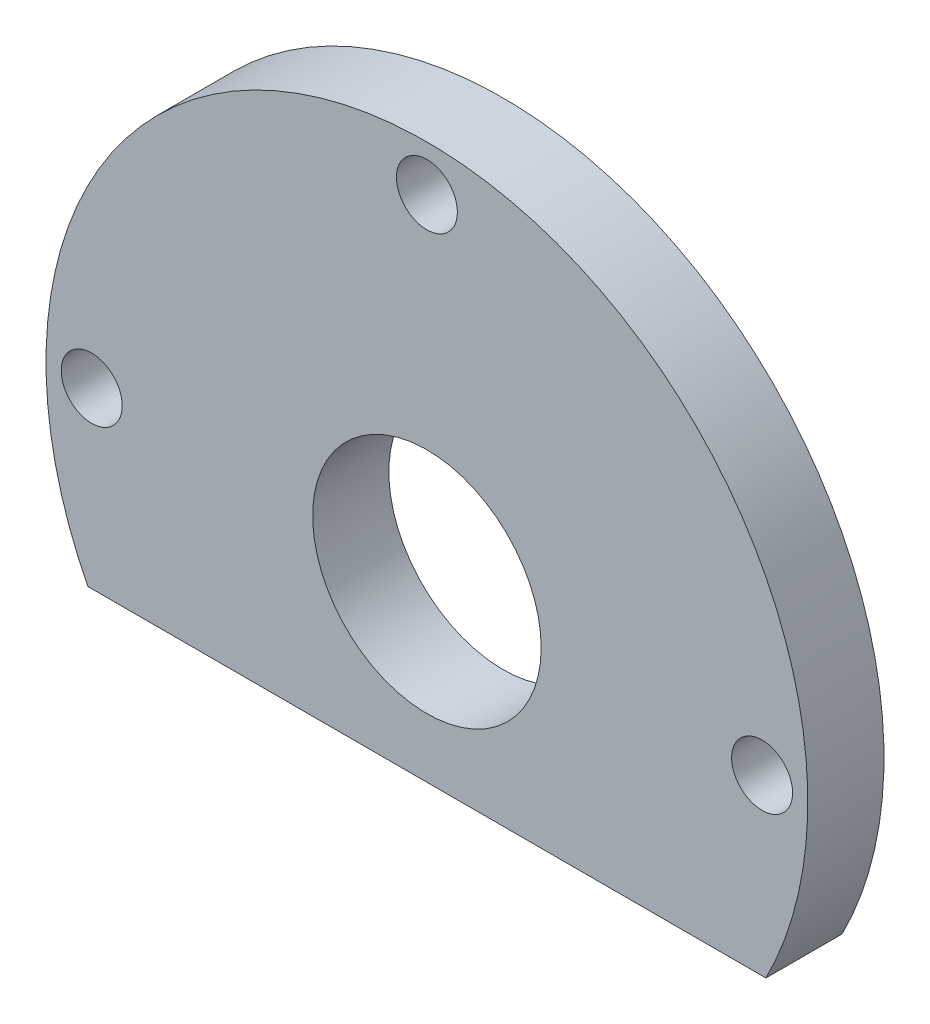
ISO-10303-21;
HEADER;
FILE_DESCRIPTION(('STEP AP214'),'2;1');
FILE_NAME('part.step','',(''),(''),'','','');
FILE_SCHEMA(('AUTOMOTIVE_DESIGN { 1 0 10303 214 1 1 1 1 }'));
ENDSEC;
DATA;
#1=APPLICATION_CONTEXT('core data for automotive mechanical design processes');
#2=APPLICATION_PROTOCOL_DEFINITION('international standard','automotive_design',2000,#1);
#3=PRODUCT_CONTEXT('',#1,'mechanical');
#4=PRODUCT('Part','Part','',(#3));
#5=PRODUCT_RELATED_PRODUCT_CATEGORY('part','',(#4));
#6=PRODUCT_DEFINITION_FORMATION('','',#4);
#7=PRODUCT_DEFINITION_CONTEXT('part definition',#1,'design');
#8=PRODUCT_DEFINITION('design','',#6,#7);
#9=PRODUCT_DEFINITION_SHAPE('','',#8);
#10=(LENGTH_UNIT() NAMED_UNIT(*) SI_UNIT(.MILLI.,.METRE.));
#11=(NAMED_UNIT(*) PLANE_ANGLE_UNIT() SI_UNIT($,.RADIAN.));
#12=(NAMED_UNIT(*) SI_UNIT($,.STERADIAN.) SOLID_ANGLE_UNIT());
#13=UNCERTAINTY_MEASURE_WITH_UNIT(LENGTH_MEASURE(1.E-05),#10,'distance_accuracy_value','');
#14=(GEOMETRIC_REPRESENTATION_CONTEXT(3) GLOBAL_UNCERTAINTY_ASSIGNED_CONTEXT((#13)) GLOBAL_UNIT_ASSIGNED_CONTEXT((#10,
#11,#12)) REPRESENTATION_CONTEXT('',''));
#15=CARTESIAN_POINT('',(0.,0.,0.));
#16=DIRECTION('',(0.,0.,1.));
#17=DIRECTION('',(1.,0.,0.));
#18=AXIS2_PLACEMENT_3D('',#15,#16,#17);
#19=CARTESIAN_POINT('',(0.,0.,5.));
#20=DIRECTION('',(0.,0.,1.));
#21=DIRECTION('',(1.,0.,0.));
#22=AXIS2_PLACEMENT_3D('',#19,#20,#21);
#23=PLANE('',#22);
#24=DIRECTION('',(-1.,0.,0.));
#25=VECTOR('',#24,1.);
#26=CARTESIAN_POINT('',(-22.2496891500867,-11.39961985,5.));
#27=LINE('',#26,#25);
#28=CARTESIAN_POINT('',(22.2496891500867,-11.39961985,5.));
#29=VERTEX_POINT('',#28);
#30=CARTESIAN_POINT('',(-22.2496891500867,-11.39961985,5.));
#31=VERTEX_POINT('',#30);
#32=EDGE_CURVE('E48',#29,#31,#27,.T.);
#33=ORIENTED_EDGE('',*,*,#32,.F.);
#34=CARTESIAN_POINT('',(0.,0.,5.));
#35=DIRECTION('',(0.,0.,1.));
#36=DIRECTION('',(1.,0.,0.));
#37=AXIS2_PLACEMENT_3D('',#34,#35,#36);
#38=CIRCLE('',#37,25.);
#39=EDGE_CURVE('E11',#29,#31,#38,.T.);
#40=ORIENTED_EDGE('',*,*,#39,.T.);
#41=EDGE_LOOP('',(#33,#40));
#42=FACE_BOUND('',#41,.T.);
#43=CARTESIAN_POINT('',(0.,22.,5.));
#44=DIRECTION('',(0.,0.,1.));
#45=DIRECTION('',(1.,0.,0.));
#46=AXIS2_PLACEMENT_3D('',#43,#44,#45);
#47=CIRCLE('',#46,2.);
#48=CARTESIAN_POINT('',(2.,22.,5.));
#49=VERTEX_POINT('',#48);
#50=EDGE_CURVE('E79',#49,#49,#47,.T.);
#51=ORIENTED_EDGE('',*,*,#50,.F.);
#52=EDGE_LOOP('',(#51));
#53=FACE_BOUND('',#52,.T.);
#54=CARTESIAN_POINT('',(22.,0.,5.));
#55=DIRECTION('',(0.,0.,1.));
#56=DIRECTION('',(1.,0.,0.));
#57=AXIS2_PLACEMENT_3D('',#54,#55,#56);
#58=CIRCLE('',#57,2.);
#59=CARTESIAN_POINT('',(24.,0.,5.));
#60=VERTEX_POINT('',#59);
#61=EDGE_CURVE('E85',#60,#60,#58,.T.);
#62=ORIENTED_EDGE('',*,*,#61,.F.);
#63=EDGE_LOOP('',(#62));
#64=FACE_BOUND('',#63,.T.);
#65=CARTESIAN_POINT('',(-22.,0.,5.));
#66=DIRECTION('',(0.,0.,1.));
#67=DIRECTION('',(1.,0.,0.));
#68=AXIS2_PLACEMENT_3D('',#65,#66,#67);
#69=CIRCLE('',#68,2.);
#70=CARTESIAN_POINT('',(-20.,0.,5.));
#71=VERTEX_POINT('',#70);
#72=EDGE_CURVE('E91',#71,#71,#69,.T.);
#73=ORIENTED_EDGE('',*,*,#72,.F.);
#74=EDGE_LOOP('',(#73));
#75=FACE_BOUND('',#74,.T.);
#76=CARTESIAN_POINT('',(0.,0.,5.));
#77=DIRECTION('',(0.,0.,1.));
#78=DIRECTION('',(1.,0.,0.));
#79=AXIS2_PLACEMENT_3D('',#76,#77,#78);
#80=CIRCLE('',#79,7.5);
#81=CARTESIAN_POINT('',(7.5,0.,5.));
#82=VERTEX_POINT('',#81);
#83=EDGE_CURVE('E73',#82,#82,#80,.T.);
#84=ORIENTED_EDGE('',*,*,#83,.F.);
#85=EDGE_LOOP('',(#84));
#86=FACE_BOUND('',#85,.T.);
#87=ADVANCED_FACE('F33',(#42,#53,#64,#75,#86),#23,.T.);
#88=CARTESIAN_POINT('',(0.,0.,0.));
#89=DIRECTION('',(0.,0.,1.));
#90=DIRECTION('',(1.,0.,0.));
#91=AXIS2_PLACEMENT_3D('',#88,#89,#90);
#92=PLANE('',#91);
#93=CARTESIAN_POINT('',(0.,22.,0.));
#94=DIRECTION('',(0.,0.,1.));
#95=DIRECTION('',(1.,0.,0.));
#96=AXIS2_PLACEMENT_3D('',#93,#94,#95);
#97=CIRCLE('',#96,2.);
#98=CARTESIAN_POINT('',(2.,22.,0.));
#99=VERTEX_POINT('',#98);
#100=EDGE_CURVE('E68',#99,#99,#97,.T.);
#101=ORIENTED_EDGE('',*,*,#100,.T.);
#102=EDGE_LOOP('',(#101));
#103=FACE_BOUND('',#102,.T.);
#104=CARTESIAN_POINT('',(22.,0.,0.));
#105=DIRECTION('',(0.,0.,1.));
#106=DIRECTION('',(1.,0.,0.));
#107=AXIS2_PLACEMENT_3D('',#104,#105,#106);
#108=CIRCLE('',#107,2.);
#109=CARTESIAN_POINT('',(24.,0.,0.));
#110=VERTEX_POINT('',#109);
#111=EDGE_CURVE('E82',#110,#110,#108,.T.);
#112=ORIENTED_EDGE('',*,*,#111,.T.);
#113=EDGE_LOOP('',(#112));
#114=FACE_BOUND('',#113,.T.);
#115=CARTESIAN_POINT('',(-22.,0.,0.));
#116=DIRECTION('',(0.,0.,1.));
#117=DIRECTION('',(1.,0.,0.));
#118=AXIS2_PLACEMENT_3D('',#115,#116,#117);
#119=CIRCLE('',#118,2.);
#120=CARTESIAN_POINT('',(-20.,0.,0.));
#121=VERTEX_POINT('',#120);
#122=EDGE_CURVE('E88',#121,#121,#119,.T.);
#123=ORIENTED_EDGE('',*,*,#122,.T.);
#124=EDGE_LOOP('',(#123));
#125=FACE_BOUND('',#124,.T.);
#126=CARTESIAN_POINT('',(0.,0.,0.));
#127=DIRECTION('',(0.,0.,1.));
#128=DIRECTION('',(1.,0.,0.));
#129=AXIS2_PLACEMENT_3D('',#126,#127,#128);
#130=CIRCLE('',#129,25.);
#131=CARTESIAN_POINT('',(22.2496891500867,-11.39961985,0.));
#132=VERTEX_POINT('',#131);
#133=CARTESIAN_POINT('',(-22.2496891500867,-11.39961985,0.));
#134=VERTEX_POINT('',#133);
#135=EDGE_CURVE('E37',#132,#134,#130,.T.);
#136=ORIENTED_EDGE('',*,*,#135,.F.);
#137=DIRECTION('',(-1.,0.,0.));
#138=VECTOR('',#137,1.);
#139=CARTESIAN_POINT('',(-22.2496891500867,-11.39961985,0.));
#140=LINE('',#139,#138);
#141=EDGE_CURVE('E60',#132,#134,#140,.T.);
#142=ORIENTED_EDGE('',*,*,#141,.T.);
#143=EDGE_LOOP('',(#136,#142));
#144=FACE_BOUND('',#143,.T.);
#145=CARTESIAN_POINT('',(0.,0.,0.));
#146=DIRECTION('',(0.,0.,1.));
#147=DIRECTION('',(1.,0.,0.));
#148=AXIS2_PLACEMENT_3D('',#145,#146,#147);
#149=CIRCLE('',#148,7.5);
#150=CARTESIAN_POINT('',(7.5,0.,0.));
#151=VERTEX_POINT('',#150);
#152=EDGE_CURVE('E70',#151,#151,#149,.T.);
#153=ORIENTED_EDGE('',*,*,#152,.T.);
#154=EDGE_LOOP('',(#153));
#155=FACE_BOUND('',#154,.T.);
#156=ADVANCED_FACE('F101',(#103,#114,#125,#144,#155),#92,.F.);
#157=CARTESIAN_POINT('',(0.,0.,5.));
#158=DIRECTION('',(0.,0.,-1.));
#159=DIRECTION('',(-1.,0.,0.));
#160=AXIS2_PLACEMENT_3D('',#157,#158,#159);
#161=CYLINDRICAL_SURFACE('',#160,25.);
#162=ORIENTED_EDGE('',*,*,#39,.F.);
#163=DIRECTION('',(0.,0.,1.));
#164=VECTOR('',#163,1.);
#165=CARTESIAN_POINT('',(22.2496891500867,-11.39961985,0.));
#166=LINE('',#165,#164);
#167=EDGE_CURVE('E58',#132,#29,#166,.T.);
#168=ORIENTED_EDGE('',*,*,#167,.F.);
#169=ORIENTED_EDGE('',*,*,#135,.T.);
#170=DIRECTION('',(0.,0.,1.));
#171=VECTOR('',#170,1.);
#172=CARTESIAN_POINT('',(-22.2496891500867,-11.39961985,0.));
#173=LINE('',#172,#171);
#174=EDGE_CURVE('E53',#134,#31,#173,.T.);
#175=ORIENTED_EDGE('',*,*,#174,.T.);
#176=EDGE_LOOP('',(#162,#168,#169,#175));
#177=FACE_BOUND('',#176,.T.);
#178=ADVANCED_FACE('F35',(#177),#161,.T.);
#179=CARTESIAN_POINT('',(0.,0.,5.));
#180=DIRECTION('',(0.,0.,-1.));
#181=DIRECTION('',(-1.,0.,0.));
#182=AXIS2_PLACEMENT_3D('',#179,#180,#181);
#183=CYLINDRICAL_SURFACE('',#182,7.5);
#184=ORIENTED_EDGE('',*,*,#83,.T.);
#185=EDGE_LOOP('',(#184));
#186=FACE_BOUND('',#185,.T.);
#187=ORIENTED_EDGE('',*,*,#152,.F.);
#188=EDGE_LOOP('',(#187));
#189=FACE_BOUND('',#188,.T.);
#190=ADVANCED_FACE('F97',(#186,#189),#183,.F.);
#191=CARTESIAN_POINT('',(-22.2496891500867,-11.39961985,0.));
#192=DIRECTION('',(0.,1.,0.));
#193=DIRECTION('',(0.,0.,1.));
#194=AXIS2_PLACEMENT_3D('',#191,#192,#193);
#195=PLANE('',#194);
#196=ORIENTED_EDGE('',*,*,#32,.T.);
#197=ORIENTED_EDGE('',*,*,#174,.F.);
#198=ORIENTED_EDGE('',*,*,#141,.F.);
#199=ORIENTED_EDGE('',*,*,#167,.T.);
#200=EDGE_LOOP('',(#196,#197,#198,#199));
#201=FACE_BOUND('',#200,.T.);
#202=ADVANCED_FACE('F59',(#201),#195,.F.);
#203=CARTESIAN_POINT('',(-22.,0.,0.));
#204=DIRECTION('',(0.,0.,1.));
#205=DIRECTION('',(1.,0.,0.));
#206=AXIS2_PLACEMENT_3D('',#203,#204,#205);
#207=CYLINDRICAL_SURFACE('',#206,2.);
#208=ORIENTED_EDGE('',*,*,#122,.F.);
#209=EDGE_LOOP('',(#208));
#210=FACE_BOUND('',#209,.T.);
#211=ORIENTED_EDGE('',*,*,#72,.T.);
#212=EDGE_LOOP('',(#211));
#213=FACE_BOUND('',#212,.T.);
#214=ADVANCED_FACE('F110',(#210,#213),#207,.F.);
#215=CARTESIAN_POINT('',(22.,0.,0.));
#216=DIRECTION('',(0.,0.,1.));
#217=DIRECTION('',(1.,0.,0.));
#218=AXIS2_PLACEMENT_3D('',#215,#216,#217);
#219=CYLINDRICAL_SURFACE('',#218,2.);
#220=ORIENTED_EDGE('',*,*,#111,.F.);
#221=EDGE_LOOP('',(#220));
#222=FACE_BOUND('',#221,.T.);
#223=ORIENTED_EDGE('',*,*,#61,.T.);
#224=EDGE_LOOP('',(#223));
#225=FACE_BOUND('',#224,.T.);
#226=ADVANCED_FACE('F113',(#222,#225),#219,.F.);
#227=CARTESIAN_POINT('',(0.,22.,0.));
#228=DIRECTION('',(0.,0.,1.));
#229=DIRECTION('',(1.,0.,0.));
#230=AXIS2_PLACEMENT_3D('',#227,#228,#229);
#231=CYLINDRICAL_SURFACE('',#230,2.);
#232=ORIENTED_EDGE('',*,*,#100,.F.);
#233=EDGE_LOOP('',(#232));
#234=FACE_BOUND('',#233,.T.);
#235=ORIENTED_EDGE('',*,*,#50,.T.);
#236=EDGE_LOOP('',(#235));
#237=FACE_BOUND('',#236,.T.);
#238=ADVANCED_FACE('F117',(#234,#237),#231,.F.);
#239=CLOSED_SHELL('',(#87,#156,#178,#190,#202,#214,#226,#238));
#240=MANIFOLD_SOLID_BREP('B2',#239);
#241=ADVANCED_BREP_SHAPE_REPRESENTATION('',(#18,#240),#14);
#242=SHAPE_DEFINITION_REPRESENTATION(#9,#241);
ENDSEC;
END-ISO-10303-21;
